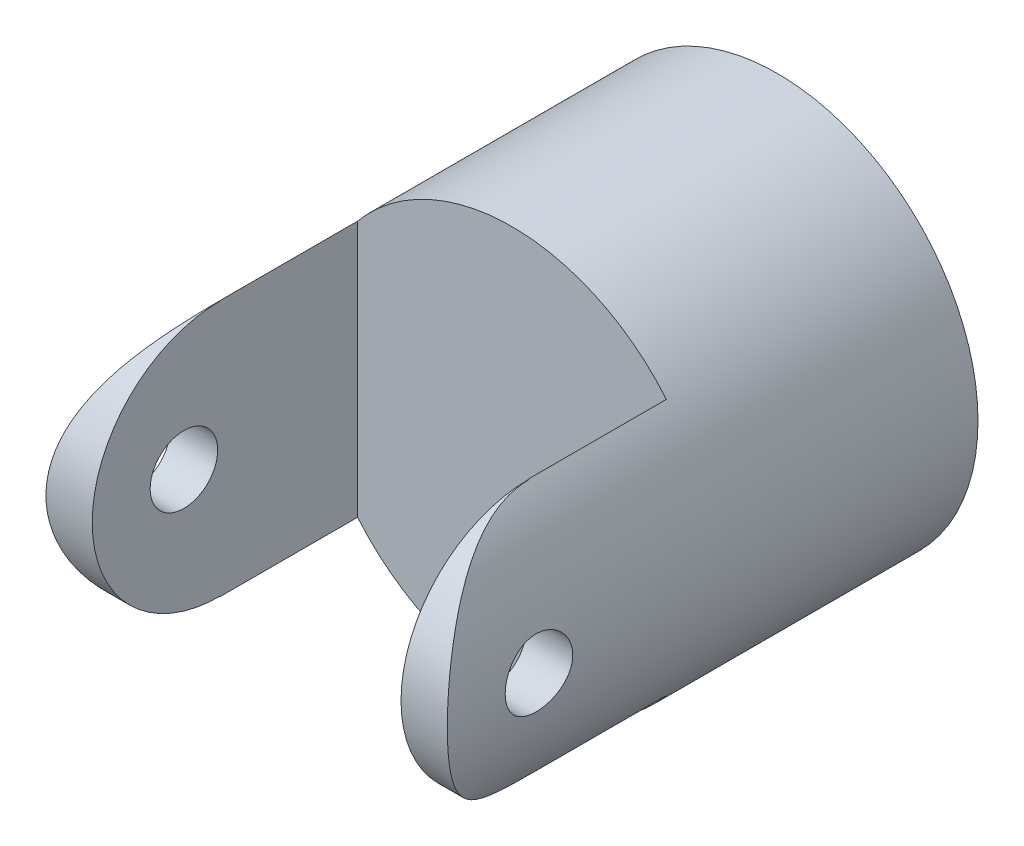
ISO-10303-21;
HEADER;
FILE_DESCRIPTION(('STEP AP214'),'2;1');
FILE_NAME('part.step','',(''),(''),'','','');
FILE_SCHEMA(('AUTOMOTIVE_DESIGN { 1 0 10303 214 1 1 1 1 }'));
ENDSEC;
DATA;
#1=APPLICATION_CONTEXT('core data for automotive mechanical design processes');
#2=APPLICATION_PROTOCOL_DEFINITION('international standard','automotive_design',2000,#1);
#3=PRODUCT_CONTEXT('',#1,'mechanical');
#4=PRODUCT('Part','Part','',(#3));
#5=PRODUCT_RELATED_PRODUCT_CATEGORY('part','',(#4));
#6=PRODUCT_DEFINITION_FORMATION('','',#4);
#7=PRODUCT_DEFINITION_CONTEXT('part definition',#1,'design');
#8=PRODUCT_DEFINITION('design','',#6,#7);
#9=PRODUCT_DEFINITION_SHAPE('','',#8);
#10=(LENGTH_UNIT() NAMED_UNIT(*) SI_UNIT(.MILLI.,.METRE.));
#11=(NAMED_UNIT(*) PLANE_ANGLE_UNIT() SI_UNIT($,.RADIAN.));
#12=(NAMED_UNIT(*) SI_UNIT($,.STERADIAN.) SOLID_ANGLE_UNIT());
#13=UNCERTAINTY_MEASURE_WITH_UNIT(LENGTH_MEASURE(1.E-05),#10,'distance_accuracy_value','');
#14=(GEOMETRIC_REPRESENTATION_CONTEXT(3) GLOBAL_UNCERTAINTY_ASSIGNED_CONTEXT((#13)) GLOBAL_UNIT_ASSIGNED_CONTEXT((#10,
#11,#12)) REPRESENTATION_CONTEXT('',''));
#15=CARTESIAN_POINT('',(0.,0.,0.));
#16=DIRECTION('',(0.,0.,1.));
#17=DIRECTION('',(1.,0.,0.));
#18=AXIS2_PLACEMENT_3D('',#15,#16,#17);
#19=CARTESIAN_POINT('',(0.,0.,11.));
#20=DIRECTION('',(0.,0.,-1.));
#21=DIRECTION('',(-1.,0.,0.));
#22=AXIS2_PLACEMENT_3D('',#19,#20,#21);
#23=CYLINDRICAL_SURFACE('',#22,4.16);
#24=CARTESIAN_POINT('',(-4.16,0.,8.4));
#25=CARTESIAN_POINT('',(-4.1599993277621,0.0390239125747628,8.40000155977883));
#26=CARTESIAN_POINT('',(-4.15944517372982,0.0780689849075887,8.4032743076211));
#27=CARTESIAN_POINT('',(-4.15728790947244,0.155063659220866,8.41627316724561));
#28=CARTESIAN_POINT('',(-4.1556838404645,0.193012226766777,8.42600517774355));
#29=CARTESIAN_POINT('',(-4.15160662871372,0.266688829253378,8.4516200868742));
#30=CARTESIAN_POINT('',(-4.1491342024726,0.302418666403529,8.46749791554888));
#31=CARTESIAN_POINT('',(-4.14359199062741,0.37070263465631,8.50494038987474));
#32=CARTESIAN_POINT('',(-4.14052227188301,0.403257120589323,8.52650439912268));
#33=CARTESIAN_POINT('',(-4.13409224580627,0.46458772784988,8.57493043107718));
#34=CARTESIAN_POINT('',(-4.13072963903228,0.493328446142046,8.6018369904627));
#35=CARTESIAN_POINT('',(-4.12411038432244,0.545909827859605,8.66008848698301));
#36=CARTESIAN_POINT('',(-4.12085374315079,0.569750178990013,8.69143370677385));
#37=CARTESIAN_POINT('',(-4.11479287163596,0.61199635700962,8.75791645283517));
#38=CARTESIAN_POINT('',(-4.11199161196014,0.630367102184491,8.79307656609853));
#39=CARTESIAN_POINT('',(-4.10719060804984,0.660928230525133,8.86603863677661));
#40=CARTESIAN_POINT('',(-4.10519080860076,0.673119039457476,8.90384041198986));
#41=CARTESIAN_POINT('',(-4.1022420557679,0.69086254711526,8.98063721227013));
#42=CARTESIAN_POINT('',(-4.10128342559077,0.696476412201096,9.01961772655558));
#43=CARTESIAN_POINT('',(-4.10049628461693,0.701096337075264,9.09797832626149));
#44=CARTESIAN_POINT('',(-4.10066769229779,0.700102873524991,9.13735838265381));
#45=CARTESIAN_POINT('',(-4.1021124270041,0.691586147504626,9.21496310071234));
#46=CARTESIAN_POINT('',(-4.10337414803079,0.68413165787628,9.25319555739738));
#47=CARTESIAN_POINT('',(-4.10683917312899,0.663012441156744,9.32785926339887));
#48=CARTESIAN_POINT('',(-4.10904251006289,0.649347497319705,9.3642904498015));
#49=CARTESIAN_POINT('',(-4.11415501382972,0.616125724703303,9.43452301139548));
#50=CARTESIAN_POINT('',(-4.11706758136741,0.596540395518846,9.46831064744649));
#51=CARTESIAN_POINT('',(-4.12326802042378,0.552054037069553,9.53214599064827));
#52=CARTESIAN_POINT('',(-4.12655592279497,0.527152570671694,9.56219338992663));
#53=CARTESIAN_POINT('',(-4.13318753266133,0.47236637629369,9.61809336013438));
#54=CARTESIAN_POINT('',(-4.13653142033276,0.442422655344115,9.64388812707109));
#55=CARTESIAN_POINT('',(-4.14285984072331,0.37860130707401,9.69009584686133));
#56=CARTESIAN_POINT('',(-4.14584437104319,0.344723653491564,9.71050876378405));
#57=CARTESIAN_POINT('',(-4.1511221620187,0.273941318469586,9.74537883203141));
#58=CARTESIAN_POINT('',(-4.15341482187015,0.237034041344438,9.75983081098754));
#59=CARTESIAN_POINT('',(-4.1570457409022,0.161268902511086,9.78231477164084));
#60=CARTESIAN_POINT('',(-4.15838408148438,0.122411207472467,9.7903473009117));
#61=CARTESIAN_POINT('',(-4.15994460407459,0.0443464102274835,9.79968583493131));
#62=CARTESIAN_POINT('',(-4.16017995079601,0.00514905333311402,9.80107118148655));
#63=CARTESIAN_POINT('',(-4.1595440480163,-0.0729176566416257,9.79728764814687));
#64=CARTESIAN_POINT('',(-4.15867284194514,-0.111787022534712,9.79211902548208));
#65=CARTESIAN_POINT('',(-4.15592987811917,-0.187848839546986,9.77544026231971));
#66=CARTESIAN_POINT('',(-4.15406433008375,-0.225050161244746,9.76396946569981));
#67=CARTESIAN_POINT('',(-4.14954102253772,-0.297001702403252,9.73505395660164));
#68=CARTESIAN_POINT('',(-4.14688321783,-0.331751781884226,9.71760890329211));
#69=CARTESIAN_POINT('',(-4.14103756729968,-0.398158605742829,9.67705881107004));
#70=CARTESIAN_POINT('',(-4.13784517038284,-0.429784726143966,9.6539042896113));
#71=CARTESIAN_POINT('',(-4.13129802571993,-0.488730817092044,9.60266051997944));
#72=CARTESIAN_POINT('',(-4.12794326595238,-0.516050468145263,9.57457090600211));
#73=CARTESIAN_POINT('',(-4.12140684889181,-0.565902760035183,9.51389821469653));
#74=CARTESIAN_POINT('',(-4.11822739594523,-0.588381753338073,9.4812707822775));
#75=CARTESIAN_POINT('',(-4.11244297967972,-0.62753977754453,9.41265632538366));
#76=CARTESIAN_POINT('',(-4.10983799789771,-0.6442189948586,9.37666940893314));
#77=CARTESIAN_POINT('',(-4.1055140656407,-0.671224072877987,9.30250651334735));
#78=CARTESIAN_POINT('',(-4.10379141775969,-0.681576481831249,9.26434042661519));
#79=CARTESIAN_POINT('',(-4.10141798088834,-0.695717505748562,9.18677960808961));
#80=CARTESIAN_POINT('',(-4.10076709673286,-0.699506703481541,9.14738498569812));
#81=CARTESIAN_POINT('',(-4.10061503803945,-0.70039725202405,9.06902118945909));
#82=CARTESIAN_POINT('',(-4.10109934457034,-0.697583058792982,9.0300529778608));
#83=CARTESIAN_POINT('',(-4.10313125058084,-0.685529497995793,8.9531529833514));
#84=CARTESIAN_POINT('',(-4.10467884642083,-0.676290152422942,8.91522119689308));
#85=CARTESIAN_POINT('',(-4.10865739445353,-0.651681156604191,8.84150439132123));
#86=CARTESIAN_POINT('',(-4.11108727872626,-0.636318915311279,8.80571683758478));
#87=CARTESIAN_POINT('',(-4.11655762981038,-0.599908920025351,8.73721334940979));
#88=CARTESIAN_POINT('',(-4.1195981278615,-0.578860875120836,8.70449757225273));
#89=CARTESIAN_POINT('',(-4.12599307843607,-0.531375902753995,8.64263988511162));
#90=CARTESIAN_POINT('',(-4.12935088277078,-0.504876889588195,8.61354597472536));
#91=CARTESIAN_POINT('',(-4.13597549546759,-0.447373004296234,8.56018888428044));
#92=CARTESIAN_POINT('',(-4.13924228266241,-0.416367094283321,8.53592681999919));
#93=CARTESIAN_POINT('',(-4.14534350893309,-0.350469460605587,8.49276545794503));
#94=CARTESIAN_POINT('',(-4.14817473607019,-0.315551872090762,8.47390519165113));
#95=CARTESIAN_POINT('',(-4.15305458015047,-0.243010434628081,8.44234710952398));
#96=CARTESIAN_POINT('',(-4.15510397288708,-0.205389312618788,8.42964318151871));
#97=CARTESIAN_POINT('',(-4.15774414448338,-0.139687071677165,8.41350289017298));
#98=CARTESIAN_POINT('',(-4.15858555014462,-0.112002502096261,8.40844745508329));
#99=CARTESIAN_POINT('',(-4.15971371512396,-0.0562156106525505,8.40169547796901));
#100=CARTESIAN_POINT('',(-4.16000048428827,-0.028113296214703,8.39999887631656));
#101=CARTESIAN_POINT('',(-4.16,0.,8.4));
#102=B_SPLINE_CURVE_WITH_KNOTS('',3,(#24,#25,#26,#27,#28,#29,#30,#31,#32,#33,#34,#35,#36,#37,
#38,#39,#40,#41,#42,#43,#44,#45,#46,#47,#48,#49,#50,#51,#52,#53,#54,#55,#56,#57,#58,#59,#60,#61,
#62,#63,#64,#65,#66,#67,#68,#69,#70,#71,#72,#73,#74,#75,#76,#77,#78,#79,#80,#81,#82,#83,#84,#85,
#86,#87,#88,#89,#90,#91,#92,#93,#94,#95,#96,#97,#98,#99,#100,#101),.UNSPECIFIED.,.T.,.F.,(4,2,2,
2,2,2,2,2,2,2,2,2,2,2,2,2,2,2,2,2,2,2,2,2,2,2,2,2,2,2,2,2,2,2,2,2,2,2,4),(0.,0.116968971867076,
0.234044909163309,0.351024470460435,0.467990944836635,0.585976836802057,0.703970245548359,
0.82270491376216,0.941431400641504,1.05904472417866,1.1766495630277,1.29301774815333,
1.40938999485922,1.52633162208068,1.6432828688337,1.76171192378295,1.88014176937935,
1.99867416270379,2.11719644423498,2.23430044546542,2.35139985074145,2.46777638798962,
2.58415956562407,2.70158922800758,2.81902759831333,2.93770721667888,3.05638302021214,
3.17455736019733,3.29272120655945,3.409382015381,3.52604242487508,3.64256209702446,
3.75908773197823,3.87702241655098,3.99498430328666,4.11377819537088,4.23245390293315,
4.31672125379096,4.4009871086749),.UNSPECIFIED.);
#103=CARTESIAN_POINT('',(-4.16,0.,8.4));
#104=VERTEX_POINT('',#103);
#105=EDGE_CURVE('E131',#104,#104,#102,.T.);
#106=ORIENTED_EDGE('',*,*,#105,.T.);
#107=EDGE_LOOP('',(#106));
#108=FACE_BOUND('',#107,.T.);
#109=CARTESIAN_POINT('',(4.16,0.,8.4));
#110=CARTESIAN_POINT('',(4.1599993277621,-0.0390239125747628,8.40000155977883));
#111=CARTESIAN_POINT('',(4.15944517372982,-0.0780689849075887,8.4032743076211));
#112=CARTESIAN_POINT('',(4.15728790947244,-0.155063659220866,8.41627316724561));
#113=CARTESIAN_POINT('',(4.1556838404645,-0.193012226766777,8.42600517774355));
#114=CARTESIAN_POINT('',(4.15160662871372,-0.266688829253378,8.4516200868742));
#115=CARTESIAN_POINT('',(4.1491342024726,-0.302418666403529,8.46749791554888));
#116=CARTESIAN_POINT('',(4.14359199062741,-0.37070263465631,8.50494038987474));
#117=CARTESIAN_POINT('',(4.14052227188301,-0.403257120589323,8.52650439912268));
#118=CARTESIAN_POINT('',(4.13409224580627,-0.46458772784988,8.57493043107718));
#119=CARTESIAN_POINT('',(4.13072963903228,-0.493328446142046,8.6018369904627));
#120=CARTESIAN_POINT('',(4.12411038432244,-0.545909827859605,8.66008848698301));
#121=CARTESIAN_POINT('',(4.12085374315079,-0.569750178990013,8.69143370677385));
#122=CARTESIAN_POINT('',(4.11479287163596,-0.61199635700962,8.75791645283517));
#123=CARTESIAN_POINT('',(4.11199161196014,-0.630367102184491,8.79307656609853));
#124=CARTESIAN_POINT('',(4.10719060804984,-0.660928230525133,8.86603863677661));
#125=CARTESIAN_POINT('',(4.10519080860076,-0.673119039457476,8.90384041198986));
#126=CARTESIAN_POINT('',(4.1022420557679,-0.69086254711526,8.98063721227013));
#127=CARTESIAN_POINT('',(4.10128342559077,-0.696476412201096,9.01961772655558));
#128=CARTESIAN_POINT('',(4.10049628461693,-0.701096337075264,9.09797832626149));
#129=CARTESIAN_POINT('',(4.10066769229779,-0.700102873524991,9.13735838265381));
#130=CARTESIAN_POINT('',(4.1021124270041,-0.691586147504626,9.21496310071234));
#131=CARTESIAN_POINT('',(4.10337414803079,-0.68413165787628,9.25319555739738));
#132=CARTESIAN_POINT('',(4.10683917312899,-0.663012441156744,9.32785926339887));
#133=CARTESIAN_POINT('',(4.10904251006289,-0.649347497319705,9.3642904498015));
#134=CARTESIAN_POINT('',(4.11415501382972,-0.616125724703303,9.43452301139548));
#135=CARTESIAN_POINT('',(4.11706758136741,-0.596540395518846,9.46831064744649));
#136=CARTESIAN_POINT('',(4.12326802042378,-0.552054037069553,9.53214599064827));
#137=CARTESIAN_POINT('',(4.12655592279497,-0.527152570671694,9.56219338992663));
#138=CARTESIAN_POINT('',(4.13318753266133,-0.47236637629369,9.61809336013438));
#139=CARTESIAN_POINT('',(4.13653142033276,-0.442422655344115,9.64388812707109));
#140=CARTESIAN_POINT('',(4.14285984072331,-0.37860130707401,9.69009584686133));
#141=CARTESIAN_POINT('',(4.14584437104319,-0.344723653491564,9.71050876378405));
#142=CARTESIAN_POINT('',(4.1511221620187,-0.273941318469586,9.74537883203141));
#143=CARTESIAN_POINT('',(4.15341482187015,-0.237034041344438,9.75983081098754));
#144=CARTESIAN_POINT('',(4.1570457409022,-0.161268902511086,9.78231477164084));
#145=CARTESIAN_POINT('',(4.15838408148438,-0.122411207472467,9.7903473009117));
#146=CARTESIAN_POINT('',(4.15994460407459,-0.0443464102274835,9.79968583493131));
#147=CARTESIAN_POINT('',(4.16017995079601,-0.00514905333311402,9.80107118148655));
#148=CARTESIAN_POINT('',(4.1595440480163,0.0729176566416257,9.79728764814687));
#149=CARTESIAN_POINT('',(4.15867284194514,0.111787022534712,9.79211902548208));
#150=CARTESIAN_POINT('',(4.15592987811917,0.187848839546986,9.77544026231971));
#151=CARTESIAN_POINT('',(4.15406433008375,0.225050161244746,9.76396946569981));
#152=CARTESIAN_POINT('',(4.14954102253772,0.297001702403252,9.73505395660164));
#153=CARTESIAN_POINT('',(4.14688321783,0.331751781884226,9.71760890329211));
#154=CARTESIAN_POINT('',(4.14103756729968,0.398158605742829,9.67705881107004));
#155=CARTESIAN_POINT('',(4.13784517038284,0.429784726143966,9.6539042896113));
#156=CARTESIAN_POINT('',(4.13129802571993,0.488730817092044,9.60266051997944));
#157=CARTESIAN_POINT('',(4.12794326595238,0.516050468145263,9.57457090600211));
#158=CARTESIAN_POINT('',(4.12140684889181,0.565902760035183,9.51389821469653));
#159=CARTESIAN_POINT('',(4.11822739594523,0.588381753338073,9.4812707822775));
#160=CARTESIAN_POINT('',(4.11244297967972,0.62753977754453,9.41265632538366));
#161=CARTESIAN_POINT('',(4.10983799789771,0.6442189948586,9.37666940893314));
#162=CARTESIAN_POINT('',(4.1055140656407,0.671224072877987,9.30250651334735));
#163=CARTESIAN_POINT('',(4.10379141775969,0.681576481831249,9.26434042661519));
#164=CARTESIAN_POINT('',(4.10141798088834,0.695717505748562,9.18677960808961));
#165=CARTESIAN_POINT('',(4.10076709673286,0.699506703481541,9.14738498569812));
#166=CARTESIAN_POINT('',(4.10061503803945,0.70039725202405,9.06902118945909));
#167=CARTESIAN_POINT('',(4.10109934457034,0.697583058792982,9.0300529778608));
#168=CARTESIAN_POINT('',(4.10313125058084,0.685529497995793,8.9531529833514));
#169=CARTESIAN_POINT('',(4.10467884642083,0.676290152422942,8.91522119689308));
#170=CARTESIAN_POINT('',(4.10865739445353,0.651681156604191,8.84150439132123));
#171=CARTESIAN_POINT('',(4.11108727872626,0.636318915311279,8.80571683758478));
#172=CARTESIAN_POINT('',(4.11655762981038,0.599908920025351,8.73721334940979));
#173=CARTESIAN_POINT('',(4.1195981278615,0.578860875120836,8.70449757225273));
#174=CARTESIAN_POINT('',(4.12599307843607,0.531375902753995,8.64263988511162));
#175=CARTESIAN_POINT('',(4.12935088277078,0.504876889588195,8.61354597472536));
#176=CARTESIAN_POINT('',(4.13597549546759,0.447373004296234,8.56018888428044));
#177=CARTESIAN_POINT('',(4.13924228266241,0.416367094283321,8.53592681999919));
#178=CARTESIAN_POINT('',(4.14534350893309,0.350469460605587,8.49276545794503));
#179=CARTESIAN_POINT('',(4.14817473607019,0.315551872090762,8.47390519165113));
#180=CARTESIAN_POINT('',(4.15305458015047,0.243010434628081,8.44234710952398));
#181=CARTESIAN_POINT('',(4.15510397288708,0.205389312618788,8.42964318151871));
#182=CARTESIAN_POINT('',(4.15774414448338,0.139687071677165,8.41350289017298));
#183=CARTESIAN_POINT('',(4.15858555014462,0.112002502096261,8.40844745508329));
#184=CARTESIAN_POINT('',(4.15971371512396,0.0562156106525505,8.40169547796901));
#185=CARTESIAN_POINT('',(4.16000048428827,0.028113296214703,8.39999887631656));
#186=CARTESIAN_POINT('',(4.16,0.,8.4));
#187=B_SPLINE_CURVE_WITH_KNOTS('',3,(#109,#110,#111,#112,#113,#114,#115,#116,#117,#118,#119,
#120,#121,#122,#123,#124,#125,#126,#127,#128,#129,#130,#131,#132,#133,#134,#135,#136,#137,#138,
#139,#140,#141,#142,#143,#144,#145,#146,#147,#148,#149,#150,#151,#152,#153,#154,#155,#156,#157,
#158,#159,#160,#161,#162,#163,#164,#165,#166,#167,#168,#169,#170,#171,#172,#173,#174,#175,#176,
#177,#178,#179,#180,#181,#182,#183,#184,#185,#186),.UNSPECIFIED.,.T.,.F.,(4,2,2,2,2,2,2,2,2,2,2,
2,2,2,2,2,2,2,2,2,2,2,2,2,2,2,2,2,2,2,2,2,2,2,2,2,2,2,4),(0.,0.116968971867076,
0.234044909163309,0.351024470460435,0.467990944836635,0.585976836802057,0.703970245548359,
0.82270491376216,0.941431400641504,1.05904472417866,1.1766495630277,1.29301774815333,
1.40938999485922,1.52633162208068,1.6432828688337,1.76171192378295,1.88014176937935,
1.99867416270379,2.11719644423498,2.23430044546542,2.35139985074145,2.46777638798962,
2.58415956562407,2.70158922800758,2.81902759831333,2.93770721667888,3.05638302021214,
3.17455736019733,3.29272120655945,3.409382015381,3.52604242487508,3.64256209702446,
3.75908773197823,3.87702241655098,3.99498430328666,4.11377819537088,4.23245390293315,
4.31672125379096,4.4009871086749),.UNSPECIFIED.);
#188=CARTESIAN_POINT('',(4.16,0.,8.4));
#189=VERTEX_POINT('',#188);
#190=EDGE_CURVE('E138',#189,#189,#187,.T.);
#191=ORIENTED_EDGE('',*,*,#190,.T.);
#192=EDGE_LOOP('',(#191));
#193=FACE_BOUND('',#192,.T.);
#194=DIRECTION('',(0.,0.,-1.));
#195=VECTOR('',#194,1.);
#196=CARTESIAN_POINT('',(3.2,2.65811963613378,11.));
#197=LINE('',#196,#195);
#198=CARTESIAN_POINT('',(3.2,2.65811963613378,5.5));
#199=VERTEX_POINT('',#198);
#200=CARTESIAN_POINT('',(3.2,2.65811963613378,8.35));
#201=VERTEX_POINT('',#200);
#202=EDGE_CURVE('E182',#199,#201,#197,.F.);
#203=ORIENTED_EDGE('',*,*,#202,.T.);
#204=CARTESIAN_POINT('',(0.,0.,8.35));
#205=DIRECTION('',(0.,0.,-1.));
#206=DIRECTION('',(-1.,0.,0.));
#207=AXIS2_PLACEMENT_3D('',#204,#205,#206);
#208=CIRCLE('',#207,4.16);
#209=CARTESIAN_POINT('',(3.20672730365399,2.65,8.35));
#210=VERTEX_POINT('',#209);
#211=EDGE_CURVE('E107',#201,#210,#208,.T.);
#212=ORIENTED_EDGE('',*,*,#211,.T.);
#213=CARTESIAN_POINT('',(3.20672730365399,2.65,8.35));
#214=CARTESIAN_POINT('',(3.20669505811809,2.6500160283953,8.41600762728984));
#215=CARTESIAN_POINT('',(3.20876451539116,2.64753446292586,8.48199574117056));
#216=CARTESIAN_POINT('',(3.21686000468512,2.63770436351235,8.6132897334531));
#217=CARTESIAN_POINT('',(3.22288144484862,2.63036147790947,8.67859631438047));
#218=CARTESIAN_POINT('',(3.23856426362669,2.61102379201802,8.8074575561479));
#219=CARTESIAN_POINT('',(3.24819241085993,2.59907143356764,8.87102269200466));
#220=CARTESIAN_POINT('',(3.27067722024509,2.57071954376607,8.99656510040091));
#221=CARTESIAN_POINT('',(3.28353467768257,2.55431891685561,9.05854197764881));
#222=CARTESIAN_POINT('',(3.32611454748676,2.49894471907308,9.24098633080575));
#223=CARTESIAN_POINT('',(3.35993644993818,2.45369268273078,9.35865168939531));
#224=CARTESIAN_POINT('',(3.43457647325418,2.34807721097754,9.58478456622257));
#225=CARTESIAN_POINT('',(3.47541252786229,2.28767485244232,9.69322741462268));
#226=CARTESIAN_POINT('',(3.56626107151885,2.14373021273325,9.91416620206438));
#227=CARTESIAN_POINT('',(3.61676021769055,2.05813888489881,10.0251318104465));
#228=CARTESIAN_POINT('',(3.71728722279422,1.87049295958019,10.2323745995469));
#229=CARTESIAN_POINT('',(3.76731489010916,1.76843195013416,10.3286460310212));
#230=CARTESIAN_POINT('',(3.86884717703238,1.5348454058189,10.5160688473868));
#231=CARTESIAN_POINT('',(3.91972805251957,1.40122264248246,10.6050055882579));
#232=CARTESIAN_POINT('',(3.98736678964662,1.18831579844764,10.7200076573631));
#233=CARTESIAN_POINT('',(4.00847126438806,1.11524286278054,10.7552827883369));
#234=CARTESIAN_POINT('',(4.04716932801902,0.965395181767101,10.8192372236001));
#235=CARTESIAN_POINT('',(4.06476539462032,0.888623096755101,10.8479211849109));
#236=CARTESIAN_POINT('',(4.09424894951388,0.740165723076318,10.8956013634813));
#237=CARTESIAN_POINT('',(4.10654021793189,0.66878394332158,10.9152955999517));
#238=CARTESIAN_POINT('',(4.1274934437329,0.524149274703781,10.9487057885936));
#239=CARTESIAN_POINT('',(4.13615753349387,0.450897512134977,10.9624252534582));
#240=CARTESIAN_POINT('',(4.14959852568186,0.303189053306739,10.9836545651541));
#241=CARTESIAN_POINT('',(4.1543779963417,0.228733186382834,10.9911685146823));
#242=CARTESIAN_POINT('',(4.1599167354821,0.0793302960709673,10.9998707866687));
#243=CARTESIAN_POINT('',(4.16067649481135,0.00438333376997673,11.0010598814578));
#244=CARTESIAN_POINT('',(4.15721299561737,-0.199206688897612,10.9956282507606));
#245=CARTESIAN_POINT('',(4.14901150521583,-0.327688754379458,10.9827733557036));
#246=CARTESIAN_POINT('',(4.12131045618796,-0.580151905277748,10.9388954717403));
#247=CARTESIAN_POINT('',(4.10180999423465,-0.704132629980009,10.9078710302181));
#248=CARTESIAN_POINT('',(4.05316605362649,-0.944735368137761,10.8291156027387));
#249=CARTESIAN_POINT('',(4.02401422814085,-1.06135090761252,10.7813701538064));
#250=CARTESIAN_POINT('',(3.95829117182254,-1.28496546345559,10.6709765815365));
#251=CARTESIAN_POINT('',(3.92171885331419,-1.3919630667314,10.6083262732527));
#252=CARTESIAN_POINT('',(3.83867583176293,-1.60784718202649,10.4610422617027));
#253=CARTESIAN_POINT('',(3.79153825590707,-1.7152617391232,10.3746305218407));
#254=CARTESIAN_POINT('',(3.69466426676838,-1.9150511808397,10.186823635248));
#255=CARTESIAN_POINT('',(3.64492307670927,-2.00739704388281,10.0854002765597));
#256=CARTESIAN_POINT('',(3.54020951927387,-2.18741463652778,9.85403254771881));
#257=CARTESIAN_POINT('',(3.48546866291426,-2.27266094269475,9.72208345679977));
#258=CARTESIAN_POINT('',(3.38529956286428,-2.41934756100157,9.44267970306101));
#259=CARTESIAN_POINT('',(3.33983524936024,-2.48088093909605,9.29528860523034));
#260=CARTESIAN_POINT('',(3.28801692378069,-2.54855896361415,9.0791554870462));
#261=CARTESIAN_POINT('',(3.2744440105472,-2.56592756537774,9.0155136448719));
#262=CARTESIAN_POINT('',(3.25068197969008,-2.5959646101103,8.88651346554289));
#263=CARTESIAN_POINT('',(3.24049146008133,-2.60863500071993,8.82115585171927));
#264=CARTESIAN_POINT('',(3.22387519894656,-2.62914734735592,8.68855789981288));
#265=CARTESIAN_POINT('',(3.21748644109494,-2.63694190737749,8.6213055264091));
#266=CARTESIAN_POINT('',(3.20889148108242,-2.64738082111482,8.48604368824188));
#267=CARTESIAN_POINT('',(3.20669125515124,-2.65001781612364,8.41803328076841));
#268=CARTESIAN_POINT('',(3.20672730365399,-2.65,8.35));
#269=B_SPLINE_CURVE_WITH_KNOTS('',3,(#213,#214,#215,#216,#217,#218,#219,#220,#221,#222,#223,
#224,#225,#226,#227,#228,#229,#230,#231,#232,#233,#234,#235,#236,#237,#238,#239,#240,#241,#242,
#243,#244,#245,#246,#247,#248,#249,#250,#251,#252,#253,#254,#255,#256,#257,#258,#259,#260,#261,
#262,#263,#264,#265,#266,#267,#268),.UNSPECIFIED.,.F.,.F.,(4,2,2,2,2,2,2,2,2,2,2,2,2,2,2,2,2,2,
2,2,2,2,2,2,2,2,2,4),(0.,0.197912306414299,0.395595062230328,0.591499506597758,
0.787452243942295,1.17728912478481,1.56813799322805,2.01329217126134,2.45862007630531,
2.96067962611412,3.21186909182646,3.46288052896882,3.68773681749321,3.91246072924424,
4.1370359484587,4.36158374406302,4.74768030588197,5.13380773949987,5.5202699855289,
5.90678891911809,6.34218253133714,6.77840503827903,7.27514024766802,7.7699055719821,
7.97174320317075,8.17349706889667,8.37718281200512,8.58115895832141),.UNSPECIFIED.);
#270=CARTESIAN_POINT('',(3.20672730365399,-2.65,8.35));
#271=VERTEX_POINT('',#270);
#272=EDGE_CURVE('E108',#210,#271,#269,.T.);
#273=ORIENTED_EDGE('',*,*,#272,.T.);
#274=CARTESIAN_POINT('',(0.,0.,8.35));
#275=DIRECTION('',(0.,0.,-1.));
#276=DIRECTION('',(-1.,0.,0.));
#277=AXIS2_PLACEMENT_3D('',#274,#275,#276);
#278=CIRCLE('',#277,4.16);
#279=CARTESIAN_POINT('',(3.2,-2.65811963613378,8.35));
#280=VERTEX_POINT('',#279);
#281=EDGE_CURVE('E121',#271,#280,#278,.T.);
#282=ORIENTED_EDGE('',*,*,#281,.T.);
#283=DIRECTION('',(0.,0.,-1.));
#284=VECTOR('',#283,1.);
#285=CARTESIAN_POINT('',(3.2,-2.65811963613378,11.));
#286=LINE('',#285,#284);
#287=CARTESIAN_POINT('',(3.2,-2.65811963613378,5.5));
#288=VERTEX_POINT('',#287);
#289=EDGE_CURVE('E187',#280,#288,#286,.T.);
#290=ORIENTED_EDGE('',*,*,#289,.T.);
#291=CARTESIAN_POINT('',(0.,0.,5.5));
#292=DIRECTION('',(0.,0.,-1.));
#293=DIRECTION('',(-1.,0.,0.));
#294=AXIS2_PLACEMENT_3D('',#291,#292,#293);
#295=CIRCLE('',#294,4.16);
#296=CARTESIAN_POINT('',(-3.2,-2.65811963613378,5.5));
#297=VERTEX_POINT('',#296);
#298=EDGE_CURVE('E198',#288,#297,#295,.T.);
#299=ORIENTED_EDGE('',*,*,#298,.T.);
#300=DIRECTION('',(0.,0.,-1.));
#301=VECTOR('',#300,1.);
#302=CARTESIAN_POINT('',(-3.2,-2.65811963613378,11.));
#303=LINE('',#302,#301);
#304=CARTESIAN_POINT('',(-3.2,-2.65811963613378,8.35));
#305=VERTEX_POINT('',#304);
#306=EDGE_CURVE('E118',#297,#305,#303,.F.);
#307=ORIENTED_EDGE('',*,*,#306,.T.);
#308=CARTESIAN_POINT('',(-3.20672730365399,-2.65,8.35));
#309=VERTEX_POINT('',#308);
#310=EDGE_CURVE('E46',#305,#309,#278,.T.);
#311=ORIENTED_EDGE('',*,*,#310,.T.);
#312=CARTESIAN_POINT('',(-3.20672730365399,-2.65,8.35));
#313=CARTESIAN_POINT('',(-3.2066950569446,-2.65001603233073,8.41600786618289));
#314=CARTESIAN_POINT('',(-3.20876452986633,-2.6475344468261,8.48199622095595));
#315=CARTESIAN_POINT('',(-3.21686007840042,-2.63770427239442,8.61329068726936));
#316=CARTESIAN_POINT('',(-3.22288156206535,-2.63036133191998,8.67859750135164));
#317=CARTESIAN_POINT('',(-3.23856443279243,-2.61102358495306,8.80745872341925));
#318=CARTESIAN_POINT('',(-3.24819256173721,-2.59907125438728,8.87102361493784));
#319=CARTESIAN_POINT('',(-3.27067731712963,-2.5707194105278,8.99656556076683));
#320=CARTESIAN_POINT('',(-3.2835347388135,-2.55431880173449,9.0585422198147));
#321=CARTESIAN_POINT('',(-3.32611457476561,-2.49894475446523,9.24098648701093));
#322=CARTESIAN_POINT('',(-3.35993646170183,-2.45369304916129,9.35865186754687));
#323=CARTESIAN_POINT('',(-3.43457669832319,-2.34807650845614,9.58478510498086));
#324=CARTESIAN_POINT('',(-3.47541296077156,-2.28767279258207,9.69322832394361));
#325=CARTESIAN_POINT('',(-3.56625955812675,-2.14373417542528,9.91416268500063));
#326=CARTESIAN_POINT('',(-3.61675627016061,-2.0581516201372,10.0251233979166));
#327=CARTESIAN_POINT('',(-3.71728660122356,-1.87048875196189,10.2323735925183));
#328=CARTESIAN_POINT('',(-3.76732000894074,-1.76840126866439,10.3286566621578));
#329=CARTESIAN_POINT('',(-3.8688492910669,-1.53486185874963,10.5160714169269));
#330=CARTESIAN_POINT('',(-3.91971761678179,-1.40132533167105,10.6049793697717));
#331=CARTESIAN_POINT('',(-4.00989192119378,-1.1173435286487,10.7583142524245));
#332=CARTESIAN_POINT('',(-4.04921277108696,-0.966920348216277,10.8227727005503));
#333=CARTESIAN_POINT('',(-4.10598842074772,-0.681066195574498,10.9145838034583));
#334=CARTESIAN_POINT('',(-4.1260630588641,-0.547606621993921,10.9464514106566));
#335=CARTESIAN_POINT('',(-4.15306256562993,-0.276091731297322,10.9891499003433));
#336=CARTESIAN_POINT('',(-4.15999800756453,-0.138040200507549,10.9999976979112));
#337=CARTESIAN_POINT('',(-4.16000193935794,0.134362875325561,11.0000022407623));
#338=CARTESIAN_POINT('',(-4.15343491637915,0.268715015994844,10.9897291270513));
#339=CARTESIAN_POINT('',(-4.12783259780039,0.533163012478475,10.9492585268422));
#340=CARTESIAN_POINT('',(-4.10879262488342,0.66325725237042,10.9190535659328));
#341=CARTESIAN_POINT('',(-4.06013823412719,0.915023056300292,10.8404949745796));
#342=CARTESIAN_POINT('',(-4.0305701571117,1.0367287848497,10.7922208310381));
#343=CARTESIAN_POINT('',(-3.96329579799949,1.26989365901362,10.6795181501988));
#344=CARTESIAN_POINT('',(-3.92558868360515,1.38135175504229,10.6150879606754));
#345=CARTESIAN_POINT('',(-3.8415043235843,1.60105499277028,10.4661628419323));
#346=CARTESIAN_POINT('',(-3.79467192621944,1.70830638298094,10.3804643891463));
#347=CARTESIAN_POINT('',(-3.6983459740994,1.90791855907305,10.1941862081327));
#348=CARTESIAN_POINT('',(-3.64884786884299,2.0002527322788,10.0935804846254));
#349=CARTESIAN_POINT('',(-3.54431232561143,2.18077977305783,9.8636200954213));
#350=CARTESIAN_POINT('',(-3.48949306427323,2.26649898089916,9.7322116169376));
#351=CARTESIAN_POINT('',(-3.38894825584364,2.41425361264903,9.453860852767));
#352=CARTESIAN_POINT('',(-3.34318836242538,2.4763793417481,9.30698060265994));
#353=CARTESIAN_POINT('',(-3.29052405428252,2.54532856298086,9.09044275214302));
#354=CARTESIAN_POINT('',(-3.27655217465774,2.56323955814269,9.02589410258745));
#355=CARTESIAN_POINT('',(-3.25207648674413,2.59422181579563,8.89500400208282));
#356=CARTESIAN_POINT('',(-3.2415712138379,2.60729512246083,8.82866332110424));
#357=CARTESIAN_POINT('',(-3.22443216118824,2.62846658002187,8.69401504794051));
#358=CARTESIAN_POINT('',(-3.21783735754271,2.63651468478133,8.62569454704852));
#359=CARTESIAN_POINT('',(-3.2089625245374,2.64729484638864,8.48825826349253));
#360=CARTESIAN_POINT('',(-3.20668894286933,2.65001895948402,8.41914144698602));
#361=CARTESIAN_POINT('',(-3.20672730365399,2.65,8.35));
#362=B_SPLINE_CURVE_WITH_KNOTS('',3,(#312,#313,#314,#315,#316,#317,#318,#319,#320,#321,#322,
#323,#324,#325,#326,#327,#328,#329,#330,#331,#332,#333,#334,#335,#336,#337,#338,#339,#340,#341,
#342,#343,#344,#345,#346,#347,#348,#349,#350,#351,#352,#353,#354,#355,#356,#357,#358,#359,#360,
#361),.UNSPECIFIED.,.F.,.F.,(4,2,2,2,2,2,2,2,2,2,2,2,2,2,2,2,2,2,2,2,2,2,2,2,4),(0.,
0.19791302635126,0.395596498391126,0.591500226042087,0.787452243756272,1.17728974135386,
1.56813799281474,2.01328207878496,2.45862007564806,2.96076458630949,3.46225955502895,
3.87614858071767,4.28970440272061,4.69224329463494,5.09493322384377,5.49587213783643,
5.89685207126567,6.33035331513185,6.76461959349507,7.26089080684145,7.75524290024823,
7.96030445067044,8.16527925274726,8.37226414197891,8.5795576314723),.UNSPECIFIED.);
#363=CARTESIAN_POINT('',(-3.20672730365399,2.65,8.35));
#364=VERTEX_POINT('',#363);
#365=EDGE_CURVE('E100',#309,#364,#362,.T.);
#366=ORIENTED_EDGE('',*,*,#365,.T.);
#367=CARTESIAN_POINT('',(-3.2,2.65811963613378,8.35));
#368=VERTEX_POINT('',#367);
#369=EDGE_CURVE('E177',#364,#368,#208,.T.);
#370=ORIENTED_EDGE('',*,*,#369,.T.);
#371=DIRECTION('',(0.,0.,-1.));
#372=VECTOR('',#371,1.);
#373=CARTESIAN_POINT('',(-3.2,2.65811963613378,11.));
#374=LINE('',#373,#372);
#375=CARTESIAN_POINT('',(-3.2,2.65811963613378,5.5));
#376=VERTEX_POINT('',#375);
#377=EDGE_CURVE('E190',#368,#376,#374,.T.);
#378=ORIENTED_EDGE('',*,*,#377,.T.);
#379=EDGE_CURVE('E195',#376,#199,#295,.T.);
#380=ORIENTED_EDGE('',*,*,#379,.T.);
#381=EDGE_LOOP('',(#203,#212,#273,#282,#290,#299,#307,#311,#366,#370,#378,#380));
#382=FACE_BOUND('',#381,.T.);
#383=CARTESIAN_POINT('',(0.,0.,0.));
#384=DIRECTION('',(0.,0.,1.));
#385=DIRECTION('',(1.,0.,0.));
#386=AXIS2_PLACEMENT_3D('',#383,#384,#385);
#387=CIRCLE('',#386,4.16);
#388=CARTESIAN_POINT('',(4.16,0.,0.));
#389=VERTEX_POINT('',#388);
#390=EDGE_CURVE('E192',#389,#389,#387,.T.);
#391=ORIENTED_EDGE('',*,*,#390,.T.);
#392=EDGE_LOOP('',(#391));
#393=FACE_BOUND('',#392,.T.);
#394=ADVANCED_FACE('F30',(#108,#193,#382,#393),#23,.T.);
#395=CARTESIAN_POINT('',(0.,0.,0.));
#396=DIRECTION('',(0.,0.,1.));
#397=DIRECTION('',(1.,0.,0.));
#398=AXIS2_PLACEMENT_3D('',#395,#396,#397);
#399=PLANE('',#398);
#400=ORIENTED_EDGE('',*,*,#390,.F.);
#401=EDGE_LOOP('',(#400));
#402=FACE_BOUND('',#401,.T.);
#403=ADVANCED_FACE('F218',(#402),#399,.F.);
#404=CARTESIAN_POINT('',(-3.2,-4.16,5.5));
#405=DIRECTION('',(0.,0.,-1.));
#406=DIRECTION('',(-1.,0.,0.));
#407=AXIS2_PLACEMENT_3D('',#404,#405,#406);
#408=PLANE('',#407);
#409=DIRECTION('',(0.,1.,0.));
#410=VECTOR('',#409,1.);
#411=CARTESIAN_POINT('',(-3.2,-4.16,5.5));
#412=LINE('',#411,#410);
#413=EDGE_CURVE('E179',#297,#376,#412,.T.);
#414=ORIENTED_EDGE('',*,*,#413,.F.);
#415=ORIENTED_EDGE('',*,*,#298,.F.);
#416=DIRECTION('',(0.,1.,0.));
#417=VECTOR('',#416,1.);
#418=CARTESIAN_POINT('',(3.2,-4.16,5.5));
#419=LINE('',#418,#417);
#420=EDGE_CURVE('E183',#288,#199,#419,.T.);
#421=ORIENTED_EDGE('',*,*,#420,.T.);
#422=ORIENTED_EDGE('',*,*,#379,.F.);
#423=EDGE_LOOP('',(#414,#415,#421,#422));
#424=FACE_BOUND('',#423,.T.);
#425=ADVANCED_FACE('F222',(#424),#408,.F.);
#426=CARTESIAN_POINT('',(-3.2,-4.16,11.8574060192512));
#427=DIRECTION('',(-1.,0.,0.));
#428=DIRECTION('',(0.,0.,1.));
#429=AXIS2_PLACEMENT_3D('',#426,#427,#428);
#430=PLANE('',#429);
#431=CARTESIAN_POINT('',(-3.2,0.,9.1));
#432=DIRECTION('',(-1.,0.,0.));
#433=DIRECTION('',(0.,0.,1.));
#434=AXIS2_PLACEMENT_3D('',#431,#432,#433);
#435=CIRCLE('',#434,0.7);
#436=CARTESIAN_POINT('',(-3.2,0.,9.8));
#437=VERTEX_POINT('',#436);
#438=EDGE_CURVE('E142',#437,#437,#435,.T.);
#439=ORIENTED_EDGE('',*,*,#438,.T.);
#440=EDGE_LOOP('',(#439));
#441=FACE_BOUND('',#440,.T.);
#442=ORIENTED_EDGE('',*,*,#377,.F.);
#443=DIRECTION('',(0.,-1.,0.));
#444=VECTOR('',#443,1.);
#445=CARTESIAN_POINT('',(-3.2,-4.16,8.35));
#446=LINE('',#445,#444);
#447=CARTESIAN_POINT('',(-3.2,2.65,8.35));
#448=VERTEX_POINT('',#447);
#449=EDGE_CURVE('E176',#368,#448,#446,.T.);
#450=ORIENTED_EDGE('',*,*,#449,.T.);
#451=CARTESIAN_POINT('',(-3.2,0.,8.35));
#452=DIRECTION('',(-1.,0.,0.));
#453=DIRECTION('',(0.,0.,1.));
#454=AXIS2_PLACEMENT_3D('',#451,#452,#453);
#455=CIRCLE('',#454,2.65);
#456=CARTESIAN_POINT('',(-3.2,-2.65,8.35));
#457=VERTEX_POINT('',#456);
#458=EDGE_CURVE('E119',#448,#457,#455,.F.);
#459=ORIENTED_EDGE('',*,*,#458,.T.);
#460=DIRECTION('',(0.,-1.,0.));
#461=VECTOR('',#460,1.);
#462=CARTESIAN_POINT('',(-3.2,-4.16,8.35));
#463=LINE('',#462,#461);
#464=EDGE_CURVE('E111',#457,#305,#463,.T.);
#465=ORIENTED_EDGE('',*,*,#464,.T.);
#466=ORIENTED_EDGE('',*,*,#306,.F.);
#467=ORIENTED_EDGE('',*,*,#413,.T.);
#468=EDGE_LOOP('',(#442,#450,#459,#465,#466,#467));
#469=FACE_BOUND('',#468,.T.);
#470=ADVANCED_FACE('F213',(#441,#469),#430,.F.);
#471=CARTESIAN_POINT('',(3.2,-4.16,11.8574060192512));
#472=DIRECTION('',(1.,0.,0.));
#473=DIRECTION('',(0.,0.,-1.));
#474=AXIS2_PLACEMENT_3D('',#471,#472,#473);
#475=PLANE('',#474);
#476=CARTESIAN_POINT('',(3.2,0.,9.1));
#477=DIRECTION('',(1.,0.,0.));
#478=DIRECTION('',(0.,0.,-1.));
#479=AXIS2_PLACEMENT_3D('',#476,#477,#478);
#480=CIRCLE('',#479,0.7);
#481=CARTESIAN_POINT('',(3.2,0.,8.4));
#482=VERTEX_POINT('',#481);
#483=EDGE_CURVE('E34',#482,#482,#480,.T.);
#484=ORIENTED_EDGE('',*,*,#483,.T.);
#485=EDGE_LOOP('',(#484));
#486=FACE_BOUND('',#485,.T.);
#487=CARTESIAN_POINT('',(3.2,0.,8.35));
#488=DIRECTION('',(1.,0.,0.));
#489=DIRECTION('',(0.,0.,-1.));
#490=AXIS2_PLACEMENT_3D('',#487,#488,#489);
#491=CIRCLE('',#490,2.65);
#492=CARTESIAN_POINT('',(3.2,-2.65,8.35));
#493=VERTEX_POINT('',#492);
#494=CARTESIAN_POINT('',(3.2,2.65,8.35));
#495=VERTEX_POINT('',#494);
#496=EDGE_CURVE('E39',#493,#495,#491,.F.);
#497=ORIENTED_EDGE('',*,*,#496,.T.);
#498=DIRECTION('',(0.,1.,0.));
#499=VECTOR('',#498,1.);
#500=CARTESIAN_POINT('',(3.2,-4.16,8.35));
#501=LINE('',#500,#499);
#502=EDGE_CURVE('E11',#495,#201,#501,.T.);
#503=ORIENTED_EDGE('',*,*,#502,.T.);
#504=ORIENTED_EDGE('',*,*,#202,.F.);
#505=ORIENTED_EDGE('',*,*,#420,.F.);
#506=ORIENTED_EDGE('',*,*,#289,.F.);
#507=DIRECTION('',(0.,1.,0.));
#508=VECTOR('',#507,1.);
#509=CARTESIAN_POINT('',(3.2,-4.16,8.35));
#510=LINE('',#509,#508);
#511=EDGE_CURVE('E199',#280,#493,#510,.T.);
#512=ORIENTED_EDGE('',*,*,#511,.T.);
#513=EDGE_LOOP('',(#497,#503,#504,#505,#506,#512));
#514=FACE_BOUND('',#513,.T.);
#515=ADVANCED_FACE('F204',(#486,#514),#475,.F.);
#516=CARTESIAN_POINT('',(-4.16,-2.65,8.35));
#517=DIRECTION('',(0.,0.,-1.));
#518=DIRECTION('',(-1.,0.,0.));
#519=AXIS2_PLACEMENT_3D('',#516,#517,#518);
#520=PLANE('',#519);
#521=DIRECTION('',(1.,0.,0.));
#522=VECTOR('',#521,1.);
#523=CARTESIAN_POINT('',(-4.16,-2.65,8.35));
#524=LINE('',#523,#522);
#525=EDGE_CURVE('E54',#493,#271,#524,.T.);
#526=ORIENTED_EDGE('',*,*,#525,.F.);
#527=ORIENTED_EDGE('',*,*,#511,.F.);
#528=ORIENTED_EDGE('',*,*,#281,.F.);
#529=EDGE_LOOP('',(#526,#527,#528));
#530=FACE_BOUND('',#529,.T.);
#531=ADVANCED_FACE('F207',(#530),#520,.F.);
#532=CARTESIAN_POINT('',(-4.16,0.,8.35));
#533=DIRECTION('',(1.,0.,0.));
#534=DIRECTION('',(0.,0.,-1.));
#535=AXIS2_PLACEMENT_3D('',#532,#533,#534);
#536=CYLINDRICAL_SURFACE('',#535,2.65);
#537=DIRECTION('',(1.,0.,0.));
#538=VECTOR('',#537,1.);
#539=CARTESIAN_POINT('',(-4.16,2.65,8.35));
#540=LINE('',#539,#538);
#541=EDGE_CURVE('E112',#495,#210,#540,.T.);
#542=ORIENTED_EDGE('',*,*,#541,.F.);
#543=ORIENTED_EDGE('',*,*,#496,.F.);
#544=ORIENTED_EDGE('',*,*,#525,.T.);
#545=ORIENTED_EDGE('',*,*,#272,.F.);
#546=EDGE_LOOP('',(#542,#543,#544,#545));
#547=FACE_BOUND('',#546,.T.);
#548=ADVANCED_FACE('F163',(#547),#536,.T.);
#549=CARTESIAN_POINT('',(-4.16,2.65,8.35));
#550=DIRECTION('',(0.,0.,-1.));
#551=DIRECTION('',(-1.,0.,0.));
#552=AXIS2_PLACEMENT_3D('',#549,#550,#551);
#553=PLANE('',#552);
#554=ORIENTED_EDGE('',*,*,#502,.F.);
#555=ORIENTED_EDGE('',*,*,#541,.T.);
#556=ORIENTED_EDGE('',*,*,#211,.F.);
#557=EDGE_LOOP('',(#554,#555,#556));
#558=FACE_BOUND('',#557,.T.);
#559=ADVANCED_FACE('F159',(#558),#553,.F.);
#560=EDGE_CURVE('E104',#364,#448,#540,.T.);
#561=ORIENTED_EDGE('',*,*,#560,.T.);
#562=ORIENTED_EDGE('',*,*,#449,.F.);
#563=ORIENTED_EDGE('',*,*,#369,.F.);
#564=EDGE_LOOP('',(#561,#562,#563));
#565=FACE_BOUND('',#564,.T.);
#566=ADVANCED_FACE('F155',(#565),#553,.F.);
#567=ORIENTED_EDGE('',*,*,#458,.F.);
#568=ORIENTED_EDGE('',*,*,#560,.F.);
#569=ORIENTED_EDGE('',*,*,#365,.F.);
#570=EDGE_CURVE('E102',#309,#457,#524,.T.);
#571=ORIENTED_EDGE('',*,*,#570,.T.);
#572=EDGE_LOOP('',(#567,#568,#569,#571));
#573=FACE_BOUND('',#572,.T.);
#574=ADVANCED_FACE('F101',(#573),#536,.T.);
#575=ORIENTED_EDGE('',*,*,#464,.F.);
#576=ORIENTED_EDGE('',*,*,#570,.F.);
#577=ORIENTED_EDGE('',*,*,#310,.F.);
#578=EDGE_LOOP('',(#575,#576,#577));
#579=FACE_BOUND('',#578,.T.);
#580=ADVANCED_FACE('F110',(#579),#520,.F.);
#581=CARTESIAN_POINT('',(-4.16,0.,9.1));
#582=DIRECTION('',(1.,0.,0.));
#583=DIRECTION('',(0.,0.,-1.));
#584=AXIS2_PLACEMENT_3D('',#581,#582,#583);
#585=CYLINDRICAL_SURFACE('',#584,0.7);
#586=ORIENTED_EDGE('',*,*,#483,.F.);
#587=EDGE_LOOP('',(#586));
#588=FACE_BOUND('',#587,.T.);
#589=ORIENTED_EDGE('',*,*,#190,.F.);
#590=EDGE_LOOP('',(#589));
#591=FACE_BOUND('',#590,.T.);
#592=ADVANCED_FACE('F153',(#588,#591),#585,.F.);
#593=ORIENTED_EDGE('',*,*,#438,.F.);
#594=EDGE_LOOP('',(#593));
#595=FACE_BOUND('',#594,.T.);
#596=ORIENTED_EDGE('',*,*,#105,.F.);
#597=EDGE_LOOP('',(#596));
#598=FACE_BOUND('',#597,.T.);
#599=ADVANCED_FACE('F149',(#595,#598),#585,.F.);
#600=CLOSED_SHELL('',(#394,#403,#425,#470,#515,#531,#548,#559,#566,#574,#580,#592,#599));
#601=MANIFOLD_SOLID_BREP('B2',#600);
#602=ADVANCED_BREP_SHAPE_REPRESENTATION('',(#18,#601),#14);
#603=SHAPE_DEFINITION_REPRESENTATION(#9,#602);
ENDSEC;
END-ISO-10303-21;
